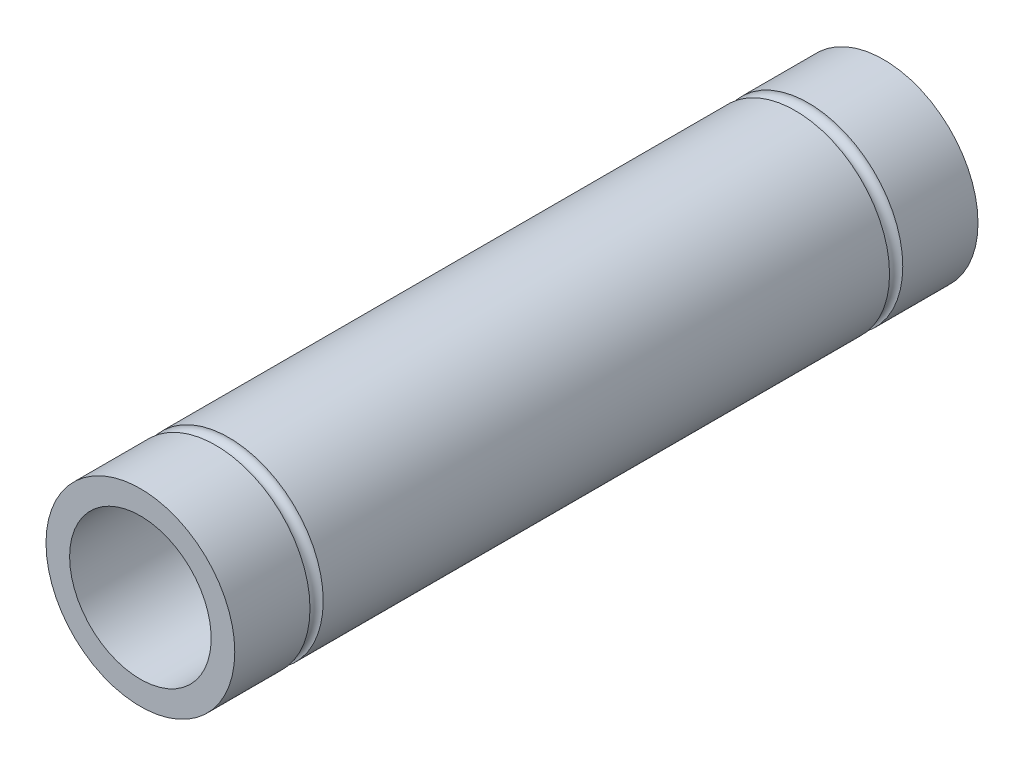
ISO-10303-21;
HEADER;
FILE_DESCRIPTION(('STEP AP214'),'2;1');
FILE_NAME('part.step','',(''),(''),'','','');
FILE_SCHEMA(('AUTOMOTIVE_DESIGN { 1 0 10303 214 1 1 1 1 }'));
ENDSEC;
DATA;
#1=APPLICATION_CONTEXT('core data for automotive mechanical design processes');
#2=APPLICATION_PROTOCOL_DEFINITION('international standard','automotive_design',2000,#1);
#3=PRODUCT_CONTEXT('',#1,'mechanical');
#4=PRODUCT('Part','Part','',(#3));
#5=PRODUCT_RELATED_PRODUCT_CATEGORY('part','',(#4));
#6=PRODUCT_DEFINITION_FORMATION('','',#4);
#7=PRODUCT_DEFINITION_CONTEXT('part definition',#1,'design');
#8=PRODUCT_DEFINITION('design','',#6,#7);
#9=PRODUCT_DEFINITION_SHAPE('','',#8);
#10=(LENGTH_UNIT() NAMED_UNIT(*) SI_UNIT(.MILLI.,.METRE.));
#11=(NAMED_UNIT(*) PLANE_ANGLE_UNIT() SI_UNIT($,.RADIAN.));
#12=(NAMED_UNIT(*) SI_UNIT($,.STERADIAN.) SOLID_ANGLE_UNIT());
#13=UNCERTAINTY_MEASURE_WITH_UNIT(LENGTH_MEASURE(1.E-05),#10,'distance_accuracy_value','');
#14=(GEOMETRIC_REPRESENTATION_CONTEXT(3) GLOBAL_UNCERTAINTY_ASSIGNED_CONTEXT((#13)) GLOBAL_UNIT_ASSIGNED_CONTEXT((#10,
#11,#12)) REPRESENTATION_CONTEXT('',''));
#15=CARTESIAN_POINT('',(0.,0.,0.));
#16=DIRECTION('',(0.,0.,1.));
#17=DIRECTION('',(1.,0.,0.));
#18=AXIS2_PLACEMENT_3D('',#15,#16,#17);
#19=CARTESIAN_POINT('',(0.,0.,50.));
#20=DIRECTION('',(0.,0.,-1.));
#21=DIRECTION('',(-1.,0.,0.));
#22=AXIS2_PLACEMENT_3D('',#19,#20,#21);
#23=CYLINDRICAL_SURFACE('',#22,6.35);
#24=CARTESIAN_POINT('',(0.,0.,44.939));
#25=DIRECTION('',(0.,0.,1.));
#26=DIRECTION('',(1.,0.,0.));
#27=AXIS2_PLACEMENT_3D('',#24,#25,#26);
#28=CIRCLE('',#27,6.35);
#29=CARTESIAN_POINT('',(6.35,0.,44.939));
#30=VERTEX_POINT('',#29);
#31=EDGE_CURVE('E54',#30,#30,#28,.T.);
#32=ORIENTED_EDGE('',*,*,#31,.T.);
#33=EDGE_LOOP('',(#32));
#34=FACE_BOUND('',#33,.T.);
#35=CARTESIAN_POINT('',(0.,0.,50.));
#36=DIRECTION('',(0.,0.,1.));
#37=DIRECTION('',(1.,0.,0.));
#38=AXIS2_PLACEMENT_3D('',#35,#36,#37);
#39=CIRCLE('',#38,6.35);
#40=CARTESIAN_POINT('',(6.35,0.,50.));
#41=VERTEX_POINT('',#40);
#42=EDGE_CURVE('E10',#41,#41,#39,.T.);
#43=ORIENTED_EDGE('',*,*,#42,.F.);
#44=EDGE_LOOP('',(#43));
#45=FACE_BOUND('',#44,.T.);
#46=ADVANCED_FACE('F33',(#34,#45),#23,.T.);
#47=CARTESIAN_POINT('',(0.,0.,0.));
#48=DIRECTION('',(0.,0.,1.));
#49=DIRECTION('',(1.,0.,0.));
#50=AXIS2_PLACEMENT_3D('',#47,#48,#49);
#51=CIRCLE('',#50,6.35);
#52=CARTESIAN_POINT('',(6.35,0.,0.));
#53=VERTEX_POINT('',#52);
#54=EDGE_CURVE('E36',#53,#53,#51,.T.);
#55=ORIENTED_EDGE('',*,*,#54,.T.);
#56=EDGE_LOOP('',(#55));
#57=FACE_BOUND('',#56,.T.);
#58=CARTESIAN_POINT('',(0.,0.,5.061));
#59=DIRECTION('',(0.,0.,1.));
#60=DIRECTION('',(1.,0.,0.));
#61=AXIS2_PLACEMENT_3D('',#58,#59,#60);
#62=CIRCLE('',#61,6.35);
#63=CARTESIAN_POINT('',(6.35,0.,5.061));
#64=VERTEX_POINT('',#63);
#65=EDGE_CURVE('E55',#64,#64,#62,.T.);
#66=ORIENTED_EDGE('',*,*,#65,.F.);
#67=EDGE_LOOP('',(#66));
#68=FACE_BOUND('',#67,.T.);
#69=ADVANCED_FACE('F75',(#57,#68),#23,.T.);
#70=CARTESIAN_POINT('',(0.,0.,50.));
#71=DIRECTION('',(0.,0.,1.));
#72=DIRECTION('',(1.,0.,0.));
#73=AXIS2_PLACEMENT_3D('',#70,#71,#72);
#74=PLANE('',#73);
#75=CARTESIAN_POINT('',(0.,0.,50.));
#76=DIRECTION('',(0.,0.,-1.));
#77=DIRECTION('',(-1.,0.,0.));
#78=AXIS2_PLACEMENT_3D('',#75,#76,#77);
#79=CIRCLE('',#78,4.76249999999999);
#80=CARTESIAN_POINT('',(-4.76249999999999,0.,50.));
#81=VERTEX_POINT('',#80);
#82=EDGE_CURVE('E43',#81,#81,#79,.T.);
#83=ORIENTED_EDGE('',*,*,#82,.T.);
#84=EDGE_LOOP('',(#83));
#85=FACE_BOUND('',#84,.T.);
#86=ORIENTED_EDGE('',*,*,#42,.T.);
#87=EDGE_LOOP('',(#86));
#88=FACE_BOUND('',#87,.T.);
#89=ADVANCED_FACE('F92',(#85,#88),#74,.T.);
#90=CARTESIAN_POINT('',(0.,0.,0.));
#91=DIRECTION('',(0.,0.,1.));
#92=DIRECTION('',(1.,0.,0.));
#93=AXIS2_PLACEMENT_3D('',#90,#91,#92);
#94=PLANE('',#93);
#95=CARTESIAN_POINT('',(0.,0.,0.));
#96=DIRECTION('',(0.,0.,-1.));
#97=DIRECTION('',(-1.,0.,0.));
#98=AXIS2_PLACEMENT_3D('',#95,#96,#97);
#99=CIRCLE('',#98,4.76249999999999);
#100=CARTESIAN_POINT('',(-4.76249999999999,0.,0.));
#101=VERTEX_POINT('',#100);
#102=EDGE_CURVE('E47',#101,#101,#99,.T.);
#103=ORIENTED_EDGE('',*,*,#102,.F.);
#104=EDGE_LOOP('',(#103));
#105=FACE_BOUND('',#104,.T.);
#106=ORIENTED_EDGE('',*,*,#54,.F.);
#107=EDGE_LOOP('',(#106));
#108=FACE_BOUND('',#107,.T.);
#109=ADVANCED_FACE('F85',(#105,#108),#94,.F.);
#110=CARTESIAN_POINT('',(0.,0.,0.));
#111=DIRECTION('',(0.,0.,-1.));
#112=DIRECTION('',(-1.,0.,0.));
#113=AXIS2_PLACEMENT_3D('',#110,#111,#112);
#114=CYLINDRICAL_SURFACE('',#113,4.76249999999999);
#115=ORIENTED_EDGE('',*,*,#82,.F.);
#116=EDGE_LOOP('',(#115));
#117=FACE_BOUND('',#116,.T.);
#118=ORIENTED_EDGE('',*,*,#102,.T.);
#119=EDGE_LOOP('',(#118));
#120=FACE_BOUND('',#119,.T.);
#121=ADVANCED_FACE('F79',(#117,#120),#114,.F.);
#122=CARTESIAN_POINT('',(0.,0.,5.5055));
#123=DIRECTION('',(0.,0.,1.));
#124=DIRECTION('',(1.,0.,0.));
#125=AXIS2_PLACEMENT_3D('',#122,#123,#124);
#126=TOROIDAL_SURFACE('',#125,6.35,0.4445);
#127=ORIENTED_EDGE('',*,*,#65,.T.);
#128=EDGE_LOOP('',(#127));
#129=FACE_BOUND('',#128,.T.);
#130=CARTESIAN_POINT('',(0.,0.,5.95));
#131=DIRECTION('',(0.,0.,1.));
#132=DIRECTION('',(1.,0.,0.));
#133=AXIS2_PLACEMENT_3D('',#130,#131,#132);
#134=CIRCLE('',#133,6.35);
#135=CARTESIAN_POINT('',(6.35,0.,5.95));
#136=VERTEX_POINT('',#135);
#137=EDGE_CURVE('E51',#136,#136,#134,.T.);
#138=ORIENTED_EDGE('',*,*,#137,.F.);
#139=EDGE_LOOP('',(#138));
#140=FACE_BOUND('',#139,.T.);
#141=ADVANCED_FACE('F74',(#129,#140),#126,.F.);
#142=CARTESIAN_POINT('',(0.,0.,44.05));
#143=DIRECTION('',(0.,0.,1.));
#144=DIRECTION('',(1.,0.,0.));
#145=AXIS2_PLACEMENT_3D('',#142,#143,#144);
#146=CIRCLE('',#145,6.35);
#147=CARTESIAN_POINT('',(6.35,0.,44.05));
#148=VERTEX_POINT('',#147);
#149=EDGE_CURVE('E50',#148,#148,#146,.T.);
#150=ORIENTED_EDGE('',*,*,#149,.F.);
#151=EDGE_LOOP('',(#150));
#152=FACE_BOUND('',#151,.T.);
#153=ORIENTED_EDGE('',*,*,#137,.T.);
#154=EDGE_LOOP('',(#153));
#155=FACE_BOUND('',#154,.T.);
#156=ADVANCED_FACE('F68',(#152,#155),#23,.T.);
#157=CARTESIAN_POINT('',(0.,0.,44.4945));
#158=DIRECTION('',(0.,0.,1.));
#159=DIRECTION('',(1.,0.,0.));
#160=AXIS2_PLACEMENT_3D('',#157,#158,#159);
#161=TOROIDAL_SURFACE('',#160,6.35,0.4445);
#162=ORIENTED_EDGE('',*,*,#31,.F.);
#163=EDGE_LOOP('',(#162));
#164=FACE_BOUND('',#163,.T.);
#165=ORIENTED_EDGE('',*,*,#149,.T.);
#166=EDGE_LOOP('',(#165));
#167=FACE_BOUND('',#166,.T.);
#168=ADVANCED_FACE('F65',(#164,#167),#161,.F.);
#169=CLOSED_SHELL('',(#46,#69,#89,#109,#121,#141,#156,#168));
#170=MANIFOLD_SOLID_BREP('B2',#169);
#171=ADVANCED_BREP_SHAPE_REPRESENTATION('',(#18,#170),#14);
#172=SHAPE_DEFINITION_REPRESENTATION(#9,#171);
ENDSEC;
END-ISO-10303-21;
